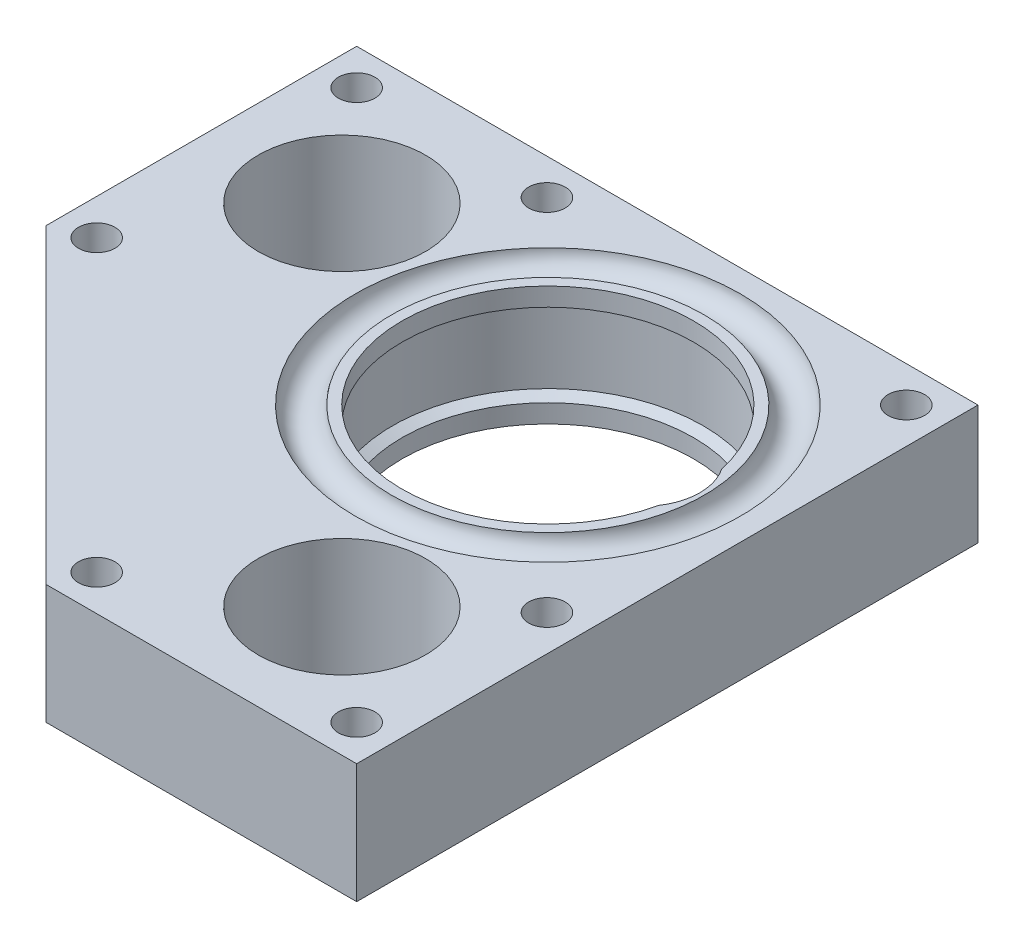
ISO-10303-21;
HEADER;
FILE_DESCRIPTION(('STEP AP214'),'2;1');
FILE_NAME('part.step','',(''),(''),'','','');
FILE_SCHEMA(('AUTOMOTIVE_DESIGN { 1 0 10303 214 1 1 1 1 }'));
ENDSEC;
DATA;
#1=APPLICATION_CONTEXT('core data for automotive mechanical design processes');
#2=APPLICATION_PROTOCOL_DEFINITION('international standard','automotive_design',2000,#1);
#3=PRODUCT_CONTEXT('',#1,'mechanical');
#4=PRODUCT('Part','Part','',(#3));
#5=PRODUCT_RELATED_PRODUCT_CATEGORY('part','',(#4));
#6=PRODUCT_DEFINITION_FORMATION('','',#4);
#7=PRODUCT_DEFINITION_CONTEXT('part definition',#1,'design');
#8=PRODUCT_DEFINITION('design','',#6,#7);
#9=PRODUCT_DEFINITION_SHAPE('','',#8);
#10=(LENGTH_UNIT() NAMED_UNIT(*) SI_UNIT(.MILLI.,.METRE.));
#11=(NAMED_UNIT(*) PLANE_ANGLE_UNIT() SI_UNIT($,.RADIAN.));
#12=(NAMED_UNIT(*) SI_UNIT($,.STERADIAN.) SOLID_ANGLE_UNIT());
#13=UNCERTAINTY_MEASURE_WITH_UNIT(LENGTH_MEASURE(1.E-05),#10,'distance_accuracy_value','');
#14=(GEOMETRIC_REPRESENTATION_CONTEXT(3) GLOBAL_UNCERTAINTY_ASSIGNED_CONTEXT((#13)) GLOBAL_UNIT_ASSIGNED_CONTEXT((#10,
#11,#12)) REPRESENTATION_CONTEXT('',''));
#15=CARTESIAN_POINT('',(0.,0.,0.));
#16=DIRECTION('',(0.,0.,1.));
#17=DIRECTION('',(1.,0.,0.));
#18=AXIS2_PLACEMENT_3D('',#15,#16,#17);
#19=CARTESIAN_POINT('',(0.,7.9375,26.9875));
#20=DIRECTION('',(0.,-1.,0.));
#21=DIRECTION('',(0.,0.,-1.));
#22=AXIS2_PLACEMENT_3D('',#19,#20,#21);
#23=PLANE('',#22);
#24=CARTESIAN_POINT('',(23.8125,7.9375,-23.8125));
#25=DIRECTION('',(0.,-1.,0.));
#26=DIRECTION('',(0.,0.,-1.));
#27=AXIS2_PLACEMENT_3D('',#24,#25,#26);
#28=CIRCLE('',#27,2.4257);
#29=CARTESIAN_POINT('',(23.8125,7.9375,-26.2382));
#30=VERTEX_POINT('',#29);
#31=EDGE_CURVE('E258',#30,#30,#28,.T.);
#32=ORIENTED_EDGE('',*,*,#31,.T.);
#33=EDGE_LOOP('',(#32));
#34=FACE_BOUND('',#33,.T.);
#35=CARTESIAN_POINT('',(-49.2125,7.9375,-23.8125));
#36=DIRECTION('',(0.,-1.,0.));
#37=DIRECTION('',(0.,0.,-1.));
#38=AXIS2_PLACEMENT_3D('',#35,#36,#37);
#39=CIRCLE('',#38,2.4257);
#40=CARTESIAN_POINT('',(-49.2125,7.9375,-26.2382));
#41=VERTEX_POINT('',#40);
#42=EDGE_CURVE('E262',#41,#41,#39,.T.);
#43=ORIENTED_EDGE('',*,*,#42,.T.);
#44=EDGE_LOOP('',(#43));
#45=FACE_BOUND('',#44,.T.);
#46=CARTESIAN_POINT('',(-23.9338853690261,7.9375,-23.8125));
#47=DIRECTION('',(0.,-1.,0.));
#48=DIRECTION('',(0.,0.,-1.));
#49=AXIS2_PLACEMENT_3D('',#46,#47,#48);
#50=CIRCLE('',#49,2.4257);
#51=CARTESIAN_POINT('',(-23.9338853690261,7.9375,-26.2382));
#52=VERTEX_POINT('',#51);
#53=EDGE_CURVE('E266',#52,#52,#50,.T.);
#54=ORIENTED_EDGE('',*,*,#53,.T.);
#55=EDGE_LOOP('',(#54));
#56=FACE_BOUND('',#55,.T.);
#57=CARTESIAN_POINT('',(-49.2125,7.9375,10.7273079091981));
#58=DIRECTION('',(0.,-1.,0.));
#59=DIRECTION('',(0.,0.,-1.));
#60=AXIS2_PLACEMENT_3D('',#57,#58,#59);
#61=CIRCLE('',#60,2.4257);
#62=CARTESIAN_POINT('',(-49.2125,7.9375,8.30160790919813));
#63=VERTEX_POINT('',#62);
#64=EDGE_CURVE('E270',#63,#63,#61,.T.);
#65=ORIENTED_EDGE('',*,*,#64,.T.);
#66=EDGE_LOOP('',(#65));
#67=FACE_BOUND('',#66,.T.);
#68=CARTESIAN_POINT('',(23.8125,7.9375,23.9338853690261));
#69=DIRECTION('',(0.,-1.,0.));
#70=DIRECTION('',(0.,0.,-1.));
#71=AXIS2_PLACEMENT_3D('',#68,#69,#70);
#72=CIRCLE('',#71,2.4257);
#73=CARTESIAN_POINT('',(23.8125,7.9375,21.5081853690261));
#74=VERTEX_POINT('',#73);
#75=EDGE_CURVE('E274',#74,#74,#72,.T.);
#76=ORIENTED_EDGE('',*,*,#75,.T.);
#77=EDGE_LOOP('',(#76));
#78=FACE_BOUND('',#77,.T.);
#79=CARTESIAN_POINT('',(23.8125,7.9375,49.2125));
#80=DIRECTION('',(0.,-1.,0.));
#81=DIRECTION('',(0.,0.,-1.));
#82=AXIS2_PLACEMENT_3D('',#79,#80,#81);
#83=CIRCLE('',#82,2.42570000000001);
#84=CARTESIAN_POINT('',(23.8125,7.9375,46.7868));
#85=VERTEX_POINT('',#84);
#86=EDGE_CURVE('E278',#85,#85,#83,.T.);
#87=ORIENTED_EDGE('',*,*,#86,.T.);
#88=EDGE_LOOP('',(#87));
#89=FACE_BOUND('',#88,.T.);
#90=CARTESIAN_POINT('',(-10.7273079091981,7.9375,49.2125));
#91=DIRECTION('',(0.,-1.,0.));
#92=DIRECTION('',(0.,0.,-1.));
#93=AXIS2_PLACEMENT_3D('',#90,#91,#92);
#94=CIRCLE('',#93,2.42570000000001);
#95=CARTESIAN_POINT('',(-10.7273079091981,7.9375,46.7868));
#96=VERTEX_POINT('',#95);
#97=EDGE_CURVE('E282',#96,#96,#94,.T.);
#98=ORIENTED_EDGE('',*,*,#97,.T.);
#99=EDGE_LOOP('',(#98));
#100=FACE_BOUND('',#99,.T.);
#101=CARTESIAN_POINT('',(9.525,7.9375,36.8901663726257));
#102=DIRECTION('',(0.,1.,0.));
#103=DIRECTION('',(0.,0.,1.));
#104=AXIS2_PLACEMENT_3D('',#101,#102,#103);
#105=CIRCLE('',#104,11.1125);
#106=CARTESIAN_POINT('',(9.525,7.9375,48.0026663726256));
#107=VERTEX_POINT('',#106);
#108=EDGE_CURVE('E286',#107,#107,#105,.T.);
#109=ORIENTED_EDGE('',*,*,#108,.F.);
#110=EDGE_LOOP('',(#109));
#111=FACE_BOUND('',#110,.T.);
#112=CARTESIAN_POINT('',(-36.8901663726257,7.9375,-9.525));
#113=DIRECTION('',(0.,1.,0.));
#114=DIRECTION('',(0.,0.,1.));
#115=AXIS2_PLACEMENT_3D('',#112,#113,#114);
#116=CIRCLE('',#115,11.1125);
#117=CARTESIAN_POINT('',(-36.8901663726257,7.9375,1.5875));
#118=VERTEX_POINT('',#117);
#119=EDGE_CURVE('E151',#118,#118,#116,.T.);
#120=ORIENTED_EDGE('',*,*,#119,.F.);
#121=EDGE_LOOP('',(#120));
#122=FACE_BOUND('',#121,.T.);
#123=CARTESIAN_POINT('',(0.,7.93749999999999,0.));
#124=DIRECTION('',(0.,-1.,0.));
#125=DIRECTION('',(0.,0.,-1.));
#126=AXIS2_PLACEMENT_3D('',#123,#124,#125);
#127=CIRCLE('',#126,25.5871555770483);
#128=CARTESIAN_POINT('',(0.,7.93749999999999,-25.5871555770483));
#129=VERTEX_POINT('',#128);
#130=EDGE_CURVE('E53',#129,#129,#127,.T.);
#131=ORIENTED_EDGE('',*,*,#130,.T.);
#132=EDGE_LOOP('',(#131));
#133=FACE_BOUND('',#132,.T.);
#134=DIRECTION('',(0.,0.,-1.));
#135=VECTOR('',#134,1.);
#136=CARTESIAN_POINT('',(28.575,7.9375,53.975));
#137=LINE('',#136,#135);
#138=CARTESIAN_POINT('',(28.575,7.9375,53.975));
#139=VERTEX_POINT('',#138);
#140=CARTESIAN_POINT('',(28.575,7.9375,-28.575));
#141=VERTEX_POINT('',#140);
#142=EDGE_CURVE('E162',#139,#141,#137,.T.);
#143=ORIENTED_EDGE('',*,*,#142,.T.);
#144=DIRECTION('',(-1.,0.,0.));
#145=VECTOR('',#144,1.);
#146=CARTESIAN_POINT('',(28.575,7.9375,-28.575));
#147=LINE('',#146,#145);
#148=CARTESIAN_POINT('',(-53.975,7.9375,-28.575));
#149=VERTEX_POINT('',#148);
#150=EDGE_CURVE('E120',#141,#149,#147,.T.);
#151=ORIENTED_EDGE('',*,*,#150,.T.);
#152=DIRECTION('',(0.,0.,1.));
#153=VECTOR('',#152,1.);
#154=CARTESIAN_POINT('',(-53.975,7.9375,-28.575));
#155=LINE('',#154,#153);
#156=CARTESIAN_POINT('',(-53.975,7.9375,12.7));
#157=VERTEX_POINT('',#156);
#158=EDGE_CURVE('E168',#149,#157,#155,.T.);
#159=ORIENTED_EDGE('',*,*,#158,.T.);
#160=DIRECTION('',(0.707106781186548,0.,0.707106781186548));
#161=VECTOR('',#160,1.);
#162=CARTESIAN_POINT('',(-53.975,7.9375,12.7));
#163=LINE('',#162,#161);
#164=CARTESIAN_POINT('',(-12.7,7.9375,53.975));
#165=VERTEX_POINT('',#164);
#166=EDGE_CURVE('E148',#157,#165,#163,.T.);
#167=ORIENTED_EDGE('',*,*,#166,.T.);
#168=DIRECTION('',(1.,0.,0.));
#169=VECTOR('',#168,1.);
#170=CARTESIAN_POINT('',(-12.7,7.9375,53.975));
#171=LINE('',#170,#169);
#172=EDGE_CURVE('E144',#165,#139,#171,.T.);
#173=ORIENTED_EDGE('',*,*,#172,.T.);
#174=EDGE_LOOP('',(#143,#151,#159,#167,#173));
#175=FACE_BOUND('',#174,.T.);
#176=ADVANCED_FACE('F39',(#34,#45,#56,#67,#78,#89,#100,#111,#122,#133,#175),#23,.F.);
#177=CARTESIAN_POINT('',(0.,8.0645,0.));
#178=DIRECTION('',(0.,-1.,0.));
#179=DIRECTION('',(0.,0.,-1.));
#180=AXIS2_PLACEMENT_3D('',#177,#178,#179);
#181=TOROIDAL_SURFACE('',#180,23.1775,2.413);
#182=ORIENTED_EDGE('',*,*,#130,.F.);
#183=EDGE_LOOP('',(#182));
#184=FACE_BOUND('',#183,.T.);
#185=CARTESIAN_POINT('',(0.,7.9375,0.));
#186=DIRECTION('',(0.,-1.,0.));
#187=DIRECTION('',(0.,0.,-1.));
#188=AXIS2_PLACEMENT_3D('',#185,#186,#187);
#189=CIRCLE('',#188,20.7678444229517);
#190=CARTESIAN_POINT('',(0.,7.9375,-20.7678444229517));
#191=VERTEX_POINT('',#190);
#192=EDGE_CURVE('E399',#191,#191,#189,.T.);
#193=ORIENTED_EDGE('',*,*,#192,.T.);
#194=EDGE_LOOP('',(#193));
#195=FACE_BOUND('',#194,.T.);
#196=ADVANCED_FACE('F248',(#184,#195),#181,.F.);
#197=CARTESIAN_POINT('',(0.,7.9375,19.3675));
#198=DIRECTION('',(0.,-1.,0.));
#199=DIRECTION('',(0.,0.,-1.));
#200=AXIS2_PLACEMENT_3D('',#197,#198,#199);
#201=PLANE('',#200);
#202=ORIENTED_EDGE('',*,*,#192,.F.);
#203=EDGE_LOOP('',(#202));
#204=FACE_BOUND('',#203,.T.);
#205=CARTESIAN_POINT('',(0.,7.9375,0.));
#206=DIRECTION('',(0.,-1.,0.));
#207=DIRECTION('',(0.,0.,-1.));
#208=AXIS2_PLACEMENT_3D('',#205,#206,#207);
#209=CIRCLE('',#208,19.3675);
#210=CARTESIAN_POINT('',(18.90728375,7.9375,4.19698432770315));
#211=VERTEX_POINT('',#210);
#212=CARTESIAN_POINT('',(18.90728375,7.9375,-4.19698432770315));
#213=VERTEX_POINT('',#212);
#214=EDGE_CURVE('E395',#211,#213,#209,.T.);
#215=ORIENTED_EDGE('',*,*,#214,.T.);
#216=CARTESIAN_POINT('',(12.7,7.9375,0.));
#217=DIRECTION('',(0.,1.,0.));
#218=DIRECTION('',(0.,0.,1.));
#219=AXIS2_PLACEMENT_3D('',#216,#217,#218);
#220=CIRCLE('',#219,7.493);
#221=EDGE_CURVE('E177',#211,#213,#220,.T.);
#222=ORIENTED_EDGE('',*,*,#221,.F.);
#223=EDGE_LOOP('',(#215,#222));
#224=FACE_BOUND('',#223,.T.);
#225=ADVANCED_FACE('F253',(#204,#224),#201,.F.);
#226=CARTESIAN_POINT('',(0.,0.,0.));
#227=DIRECTION('',(0.,-1.,0.));
#228=DIRECTION('',(0.,0.,-1.));
#229=AXIS2_PLACEMENT_3D('',#226,#227,#228);
#230=CYLINDRICAL_SURFACE('',#229,19.3675);
#231=ORIENTED_EDGE('',*,*,#214,.F.);
#232=DIRECTION('',(0.,1.,0.));
#233=VECTOR('',#232,1.);
#234=CARTESIAN_POINT('',(18.90728375,0.,4.19698432770316));
#235=LINE('',#234,#233);
#236=CARTESIAN_POINT('',(18.90728375,5.49573484187081,4.19698432770316));
#237=VERTEX_POINT('',#236);
#238=EDGE_CURVE('E413',#211,#237,#235,.F.);
#239=ORIENTED_EDGE('',*,*,#238,.T.);
#240=CARTESIAN_POINT('',(0.,5.49573484187081,0.));
#241=DIRECTION('',(0.,-1.,0.));
#242=DIRECTION('',(0.,0.,-1.));
#243=AXIS2_PLACEMENT_3D('',#240,#241,#242);
#244=CIRCLE('',#243,19.3675);
#245=CARTESIAN_POINT('',(18.90728375,5.49573484187081,-4.19698432770316));
#246=VERTEX_POINT('',#245);
#247=EDGE_CURVE('E385',#237,#246,#244,.T.);
#248=ORIENTED_EDGE('',*,*,#247,.T.);
#249=DIRECTION('',(0.,1.,0.));
#250=VECTOR('',#249,1.);
#251=CARTESIAN_POINT('',(18.90728375,0.,-4.19698432770316));
#252=LINE('',#251,#250);
#253=EDGE_CURVE('E60',#246,#213,#252,.T.);
#254=ORIENTED_EDGE('',*,*,#253,.T.);
#255=EDGE_LOOP('',(#231,#239,#248,#254));
#256=FACE_BOUND('',#255,.T.);
#257=ADVANCED_FACE('F243',(#256),#230,.F.);
#258=CARTESIAN_POINT('',(0.,4.7625,0.));
#259=DIRECTION('',(0.,-1.,0.));
#260=DIRECTION('',(0.,0.,-1.));
#261=AXIS2_PLACEMENT_3D('',#258,#259,#260);
#262=CONICAL_SURFACE('',#261,20.6375,1.0471975511966);
#263=ORIENTED_EDGE('',*,*,#247,.F.);
#264=CARTESIAN_POINT('',(18.9067554792281,5.49593484187081,4.19776552716703));
#265=CARTESIAN_POINT('',(19.0174993900621,5.4540104024532,4.03406574557647));
#266=CARTESIAN_POINT('',(19.1220398905923,5.41466474604031,3.86549214792238));
#267=CARTESIAN_POINT('',(19.3178748512189,5.34129458503462,3.51968351005283));
#268=CARTESIAN_POINT('',(19.4091674247964,5.30727083823383,3.34244724105811));
#269=CARTESIAN_POINT('',(19.5776668251635,5.24470840807489,2.98037895360555));
#270=CARTESIAN_POINT('',(19.6548683702748,5.21617178121638,2.79554411868589));
#271=CARTESIAN_POINT('',(19.7944186005398,5.16474333419237,2.41960032925531));
#272=CARTESIAN_POINT('',(19.8567683052602,5.14185112653835,2.2284918064533));
#273=CARTESIAN_POINT('',(19.9660967629609,5.10179966147627,1.84104862262559));
#274=CARTESIAN_POINT('',(20.0130541238081,5.08464838206219,1.64470709489376));
#275=CARTESIAN_POINT('',(20.0910192634318,5.05621305134426,1.24846103410571));
#276=CARTESIAN_POINT('',(20.1220269413055,5.04492903715852,1.04855647851695));
#277=CARTESIAN_POINT('',(20.1677675384391,5.02829507179111,0.646794922372262));
#278=CARTESIAN_POINT('',(20.1825121930129,5.02294084169629,0.444939435840834));
#279=CARTESIAN_POINT('',(20.1956190434831,5.01818097598665,0.0406330740790804));
#280=CARTESIAN_POINT('',(20.1939818084006,5.01877513375596,-0.16181778022709));
#281=CARTESIAN_POINT('',(20.1745186259189,5.02584444769861,-0.562201430762554));
#282=CARTESIAN_POINT('',(20.1569828173068,5.03221420311289,-0.760150260443973));
#283=CARTESIAN_POINT('',(20.1062981570415,5.05065376781338,-1.15376579767299));
#284=CARTESIAN_POINT('',(20.0731494397099,5.06272352806114,-1.34943252483921));
#285=CARTESIAN_POINT('',(19.9915361815194,5.09250778762843,-1.73718238920346));
#286=CARTESIAN_POINT('',(19.9430666058663,5.1102241425677,-1.92926432634831));
#287=CARTESIAN_POINT('',(19.8313045210998,5.15119876268703,-2.30838250797133));
#288=CARTESIAN_POINT('',(19.7680146595351,5.17445603803026,-2.49541964702258));
#289=CARTESIAN_POINT('',(19.5945656014545,5.23843200887757,-2.94836092688657));
#290=CARTESIAN_POINT('',(19.4762608302224,5.28225402633888,-3.21078600659654));
#291=CARTESIAN_POINT('',(19.2778578093211,5.3562817142002,-3.59128274756089));
#292=CARTESIAN_POINT('',(19.2083010327033,5.38231420699234,-3.71582374849114));
#293=CARTESIAN_POINT('',(19.0624819165615,5.43709858227203,-3.9603173567989));
#294=CARTESIAN_POINT('',(18.9862188269537,5.46585076897757,-4.0802694487602));
#295=CARTESIAN_POINT('',(18.9067554792275,5.49593484187104,-4.19776552716791));
#296=B_SPLINE_CURVE_WITH_KNOTS('',3,(#264,#265,#266,#267,#268,#269,#270,#271,#272,#273,#274,
#275,#276,#277,#278,#279,#280,#281,#282,#283,#284,#285,#286,#287,#288,#289,#290,#291,#292,#293,
#294,#295),.UNSPECIFIED.,.F.,.F.,(4,2,2,2,2,2,2,2,2,2,2,2,2,2,2,4),(0.,0.605966956283505,
1.2120201184126,1.81829998036732,2.42453820970712,3.03161544575461,3.63869652231194,
4.24533924510818,4.85196089638205,5.44773013398672,6.04349424614406,6.63945434429834,
7.2353080591314,8.10640598240122,8.54121047491856,8.9760636611961),.UNSPECIFIED.);
#297=EDGE_CURVE('E198',#237,#246,#296,.T.);
#298=ORIENTED_EDGE('',*,*,#297,.T.);
#299=EDGE_LOOP('',(#263,#298));
#300=FACE_BOUND('',#299,.T.);
#301=CARTESIAN_POINT('',(0.,4.7625,0.));
#302=DIRECTION('',(0.,-1.,0.));
#303=DIRECTION('',(0.,0.,-1.));
#304=AXIS2_PLACEMENT_3D('',#301,#302,#303);
#305=CIRCLE('',#304,20.6375);
#306=CARTESIAN_POINT('',(0.,4.7625,-20.6375));
#307=VERTEX_POINT('',#306);
#308=EDGE_CURVE('E379',#307,#307,#305,.T.);
#309=ORIENTED_EDGE('',*,*,#308,.T.);
#310=EDGE_LOOP('',(#309));
#311=FACE_BOUND('',#310,.T.);
#312=ADVANCED_FACE('F207',(#300,#311),#262,.F.);
#313=CARTESIAN_POINT('',(0.,0.,0.));
#314=DIRECTION('',(0.,-1.,0.));
#315=DIRECTION('',(0.,0.,-1.));
#316=AXIS2_PLACEMENT_3D('',#313,#314,#315);
#317=CYLINDRICAL_SURFACE('',#316,20.6375);
#318=ORIENTED_EDGE('',*,*,#308,.F.);
#319=EDGE_LOOP('',(#318));
#320=FACE_BOUND('',#319,.T.);
#321=CARTESIAN_POINT('',(0.,-4.7625,0.));
#322=DIRECTION('',(0.,-1.,0.));
#323=DIRECTION('',(0.,0.,-1.));
#324=AXIS2_PLACEMENT_3D('',#321,#322,#323);
#325=CIRCLE('',#324,20.6375);
#326=CARTESIAN_POINT('',(0.,-4.7625,-20.6375));
#327=VERTEX_POINT('',#326);
#328=EDGE_CURVE('E417',#327,#327,#325,.T.);
#329=ORIENTED_EDGE('',*,*,#328,.T.);
#330=EDGE_LOOP('',(#329));
#331=FACE_BOUND('',#330,.T.);
#332=ADVANCED_FACE('F236',(#320,#331),#317,.F.);
#333=CARTESIAN_POINT('',(0.,-7.9375,26.9875));
#334=DIRECTION('',(0.,1.,0.));
#335=DIRECTION('',(0.,0.,-1.));
#336=AXIS2_PLACEMENT_3D('',#333,#334,#335);
#337=PLANE('',#336);
#338=CARTESIAN_POINT('',(23.8125,-7.9375,-23.8125));
#339=DIRECTION('',(0.,1.,0.));
#340=DIRECTION('',(0.,0.,1.));
#341=AXIS2_PLACEMENT_3D('',#338,#339,#340);
#342=CIRCLE('',#341,2.4257);
#343=CARTESIAN_POINT('',(23.8125,-7.9375,-21.3868));
#344=VERTEX_POINT('',#343);
#345=EDGE_CURVE('E357',#344,#344,#342,.T.);
#346=ORIENTED_EDGE('',*,*,#345,.T.);
#347=EDGE_LOOP('',(#346));
#348=FACE_BOUND('',#347,.T.);
#349=CARTESIAN_POINT('',(-49.2125,-7.9375,-23.8125));
#350=DIRECTION('',(0.,1.,0.));
#351=DIRECTION('',(0.,0.,1.));
#352=AXIS2_PLACEMENT_3D('',#349,#350,#351);
#353=CIRCLE('',#352,2.4257);
#354=CARTESIAN_POINT('',(-49.2125,-7.9375,-21.3868));
#355=VERTEX_POINT('',#354);
#356=EDGE_CURVE('E630',#355,#355,#353,.T.);
#357=ORIENTED_EDGE('',*,*,#356,.T.);
#358=EDGE_LOOP('',(#357));
#359=FACE_BOUND('',#358,.T.);
#360=CARTESIAN_POINT('',(-23.9338853690261,-7.9375,-23.8125));
#361=DIRECTION('',(0.,1.,0.));
#362=DIRECTION('',(0.,0.,1.));
#363=AXIS2_PLACEMENT_3D('',#360,#361,#362);
#364=CIRCLE('',#363,2.4257);
#365=CARTESIAN_POINT('',(-23.9338853690261,-7.9375,-21.3868));
#366=VERTEX_POINT('',#365);
#367=EDGE_CURVE('E626',#366,#366,#364,.T.);
#368=ORIENTED_EDGE('',*,*,#367,.T.);
#369=EDGE_LOOP('',(#368));
#370=FACE_BOUND('',#369,.T.);
#371=CARTESIAN_POINT('',(-49.2125,-7.9375,10.7273079091981));
#372=DIRECTION('',(0.,1.,0.));
#373=DIRECTION('',(0.,0.,1.));
#374=AXIS2_PLACEMENT_3D('',#371,#372,#373);
#375=CIRCLE('',#374,2.4257);
#376=CARTESIAN_POINT('',(-49.2125,-7.9375,13.1530079091981));
#377=VERTEX_POINT('',#376);
#378=EDGE_CURVE('E622',#377,#377,#375,.T.);
#379=ORIENTED_EDGE('',*,*,#378,.T.);
#380=EDGE_LOOP('',(#379));
#381=FACE_BOUND('',#380,.T.);
#382=CARTESIAN_POINT('',(23.8125,-7.9375,23.9338853690261));
#383=DIRECTION('',(0.,1.,0.));
#384=DIRECTION('',(0.,0.,-1.));
#385=AXIS2_PLACEMENT_3D('',#382,#383,#384);
#386=CIRCLE('',#385,2.4257);
#387=CARTESIAN_POINT('',(23.8125,-7.9375,21.5081853690261));
#388=VERTEX_POINT('',#387);
#389=EDGE_CURVE('E618',#388,#388,#386,.T.);
#390=ORIENTED_EDGE('',*,*,#389,.T.);
#391=EDGE_LOOP('',(#390));
#392=FACE_BOUND('',#391,.T.);
#393=CARTESIAN_POINT('',(23.8125,-7.9375,49.2125));
#394=DIRECTION('',(0.,1.,0.));
#395=DIRECTION('',(0.,0.,-1.));
#396=AXIS2_PLACEMENT_3D('',#393,#394,#395);
#397=CIRCLE('',#396,2.42570000000001);
#398=CARTESIAN_POINT('',(23.8125,-7.9375,46.7868));
#399=VERTEX_POINT('',#398);
#400=EDGE_CURVE('E614',#399,#399,#397,.T.);
#401=ORIENTED_EDGE('',*,*,#400,.T.);
#402=EDGE_LOOP('',(#401));
#403=FACE_BOUND('',#402,.T.);
#404=CARTESIAN_POINT('',(-10.7273079091981,-7.9375,49.2125));
#405=DIRECTION('',(0.,1.,0.));
#406=DIRECTION('',(0.,0.,-1.));
#407=AXIS2_PLACEMENT_3D('',#404,#405,#406);
#408=CIRCLE('',#407,2.42570000000001);
#409=CARTESIAN_POINT('',(-10.7273079091981,-7.9375,46.7868));
#410=VERTEX_POINT('',#409);
#411=EDGE_CURVE('E610',#410,#410,#408,.T.);
#412=ORIENTED_EDGE('',*,*,#411,.T.);
#413=EDGE_LOOP('',(#412));
#414=FACE_BOUND('',#413,.T.);
#415=CARTESIAN_POINT('',(9.525,-7.9375,36.8901663726257));
#416=DIRECTION('',(0.,1.,0.));
#417=DIRECTION('',(0.,0.,1.));
#418=AXIS2_PLACEMENT_3D('',#415,#416,#417);
#419=CIRCLE('',#418,11.1125);
#420=CARTESIAN_POINT('',(9.525,-7.9375,48.0026663726256));
#421=VERTEX_POINT('',#420);
#422=EDGE_CURVE('E362',#421,#421,#419,.T.);
#423=ORIENTED_EDGE('',*,*,#422,.T.);
#424=EDGE_LOOP('',(#423));
#425=FACE_BOUND('',#424,.T.);
#426=CARTESIAN_POINT('',(-36.8901663726257,-7.9375,-9.525));
#427=DIRECTION('',(0.,1.,0.));
#428=DIRECTION('',(0.,0.,1.));
#429=AXIS2_PLACEMENT_3D('',#426,#427,#428);
#430=CIRCLE('',#429,11.1125);
#431=CARTESIAN_POINT('',(-36.8901663726257,-7.9375,1.5875));
#432=VERTEX_POINT('',#431);
#433=EDGE_CURVE('E165',#432,#432,#430,.T.);
#434=ORIENTED_EDGE('',*,*,#433,.T.);
#435=EDGE_LOOP('',(#434));
#436=FACE_BOUND('',#435,.T.);
#437=CARTESIAN_POINT('',(0.,-7.93749999999999,0.));
#438=DIRECTION('',(0.,-1.,0.));
#439=DIRECTION('',(0.,0.,-1.));
#440=AXIS2_PLACEMENT_3D('',#437,#438,#439);
#441=CIRCLE('',#440,25.5871555770483);
#442=CARTESIAN_POINT('',(0.,-7.93749999999999,-25.5871555770483));
#443=VERTEX_POINT('',#442);
#444=EDGE_CURVE('E377',#443,#443,#441,.T.);
#445=ORIENTED_EDGE('',*,*,#444,.F.);
#446=EDGE_LOOP('',(#445));
#447=FACE_BOUND('',#446,.T.);
#448=DIRECTION('',(0.,0.,-1.));
#449=VECTOR('',#448,1.);
#450=CARTESIAN_POINT('',(28.575,-7.9375,53.975));
#451=LINE('',#450,#449);
#452=CARTESIAN_POINT('',(28.575,-7.9375,53.975));
#453=VERTEX_POINT('',#452);
#454=CARTESIAN_POINT('',(28.575,-7.9375,-28.575));
#455=VERTEX_POINT('',#454);
#456=EDGE_CURVE('E134',#453,#455,#451,.T.);
#457=ORIENTED_EDGE('',*,*,#456,.F.);
#458=DIRECTION('',(1.,0.,0.));
#459=VECTOR('',#458,1.);
#460=CARTESIAN_POINT('',(-12.7,-7.9375,53.975));
#461=LINE('',#460,#459);
#462=CARTESIAN_POINT('',(-12.7,-7.9375,53.975));
#463=VERTEX_POINT('',#462);
#464=EDGE_CURVE('E127',#463,#453,#461,.T.);
#465=ORIENTED_EDGE('',*,*,#464,.F.);
#466=DIRECTION('',(0.707106781186548,0.,0.707106781186548));
#467=VECTOR('',#466,1.);
#468=CARTESIAN_POINT('',(-53.975,-7.9375,12.7));
#469=LINE('',#468,#467);
#470=CARTESIAN_POINT('',(-53.975,-7.9375,12.7));
#471=VERTEX_POINT('',#470);
#472=EDGE_CURVE('E156',#471,#463,#469,.T.);
#473=ORIENTED_EDGE('',*,*,#472,.F.);
#474=DIRECTION('',(0.,0.,1.));
#475=VECTOR('',#474,1.);
#476=CARTESIAN_POINT('',(-53.975,-7.9375,-28.575));
#477=LINE('',#476,#475);
#478=CARTESIAN_POINT('',(-53.975,-7.9375,-28.575));
#479=VERTEX_POINT('',#478);
#480=EDGE_CURVE('E138',#479,#471,#477,.T.);
#481=ORIENTED_EDGE('',*,*,#480,.F.);
#482=DIRECTION('',(-1.,0.,0.));
#483=VECTOR('',#482,1.);
#484=CARTESIAN_POINT('',(28.575,-7.9375,-28.575));
#485=LINE('',#484,#483);
#486=EDGE_CURVE('E118',#455,#479,#485,.T.);
#487=ORIENTED_EDGE('',*,*,#486,.F.);
#488=EDGE_LOOP('',(#457,#465,#473,#481,#487));
#489=FACE_BOUND('',#488,.T.);
#490=ADVANCED_FACE('F132',(#348,#359,#370,#381,#392,#403,#414,#425,#436,#447,#489),#337,.F.);
#491=CARTESIAN_POINT('',(0.,-8.0645,0.));
#492=DIRECTION('',(0.,1.,0.));
#493=DIRECTION('',(0.,0.,-1.));
#494=AXIS2_PLACEMENT_3D('',#491,#492,#493);
#495=TOROIDAL_SURFACE('',#494,23.1775,2.413);
#496=ORIENTED_EDGE('',*,*,#444,.T.);
#497=EDGE_LOOP('',(#496));
#498=FACE_BOUND('',#497,.T.);
#499=CARTESIAN_POINT('',(0.,-7.9375,0.));
#500=DIRECTION('',(0.,-1.,0.));
#501=DIRECTION('',(0.,0.,-1.));
#502=AXIS2_PLACEMENT_3D('',#499,#500,#501);
#503=CIRCLE('',#502,20.7678444229517);
#504=CARTESIAN_POINT('',(0.,-7.9375,-20.7678444229517));
#505=VERTEX_POINT('',#504);
#506=EDGE_CURVE('E380',#505,#505,#503,.T.);
#507=ORIENTED_EDGE('',*,*,#506,.F.);
#508=EDGE_LOOP('',(#507));
#509=FACE_BOUND('',#508,.T.);
#510=ADVANCED_FACE('F230',(#498,#509),#495,.F.);
#511=CARTESIAN_POINT('',(0.,-7.9375,19.3675));
#512=DIRECTION('',(0.,1.,0.));
#513=DIRECTION('',(0.,0.,-1.));
#514=AXIS2_PLACEMENT_3D('',#511,#512,#513);
#515=PLANE('',#514);
#516=ORIENTED_EDGE('',*,*,#506,.T.);
#517=EDGE_LOOP('',(#516));
#518=FACE_BOUND('',#517,.T.);
#519=CARTESIAN_POINT('',(0.,-7.9375,0.));
#520=DIRECTION('',(0.,-1.,0.));
#521=DIRECTION('',(0.,0.,-1.));
#522=AXIS2_PLACEMENT_3D('',#519,#520,#521);
#523=CIRCLE('',#522,19.3675);
#524=CARTESIAN_POINT('',(18.90728375,-7.9375,4.19698432770315));
#525=VERTEX_POINT('',#524);
#526=CARTESIAN_POINT('',(18.90728375,-7.9375,-4.19698432770315));
#527=VERTEX_POINT('',#526);
#528=EDGE_CURVE('E388',#525,#527,#523,.T.);
#529=ORIENTED_EDGE('',*,*,#528,.F.);
#530=CARTESIAN_POINT('',(12.7,-7.9375,0.));
#531=DIRECTION('',(0.,1.,0.));
#532=DIRECTION('',(0.,0.,1.));
#533=AXIS2_PLACEMENT_3D('',#530,#531,#532);
#534=CIRCLE('',#533,7.493);
#535=EDGE_CURVE('E188',#525,#527,#534,.T.);
#536=ORIENTED_EDGE('',*,*,#535,.T.);
#537=EDGE_LOOP('',(#529,#536));
#538=FACE_BOUND('',#537,.T.);
#539=ADVANCED_FACE('F226',(#518,#538),#515,.F.);
#540=CARTESIAN_POINT('',(0.,0.,0.));
#541=DIRECTION('',(0.,1.,0.));
#542=DIRECTION('',(0.,0.,-1.));
#543=AXIS2_PLACEMENT_3D('',#540,#541,#542);
#544=CYLINDRICAL_SURFACE('',#543,19.3675);
#545=ORIENTED_EDGE('',*,*,#528,.T.);
#546=DIRECTION('',(0.,1.,0.));
#547=VECTOR('',#546,1.);
#548=CARTESIAN_POINT('',(18.90728375,0.,-4.19698432770316));
#549=LINE('',#548,#547);
#550=CARTESIAN_POINT('',(18.90728375,-5.49573484187081,-4.19698432770316));
#551=VERTEX_POINT('',#550);
#552=EDGE_CURVE('E194',#527,#551,#549,.T.);
#553=ORIENTED_EDGE('',*,*,#552,.T.);
#554=CARTESIAN_POINT('',(0.,-5.49573484187081,0.));
#555=DIRECTION('',(0.,-1.,0.));
#556=DIRECTION('',(0.,0.,-1.));
#557=AXIS2_PLACEMENT_3D('',#554,#555,#556);
#558=CIRCLE('',#557,19.3675);
#559=CARTESIAN_POINT('',(18.90728375,-5.49573484187081,4.19698432770316));
#560=VERTEX_POINT('',#559);
#561=EDGE_CURVE('E420',#560,#551,#558,.T.);
#562=ORIENTED_EDGE('',*,*,#561,.F.);
#563=DIRECTION('',(0.,1.,0.));
#564=VECTOR('',#563,1.);
#565=CARTESIAN_POINT('',(18.90728375,0.,4.19698432770316));
#566=LINE('',#565,#564);
#567=EDGE_CURVE('E68',#560,#525,#566,.F.);
#568=ORIENTED_EDGE('',*,*,#567,.T.);
#569=EDGE_LOOP('',(#545,#553,#562,#568));
#570=FACE_BOUND('',#569,.T.);
#571=ADVANCED_FACE('F222',(#570),#544,.F.);
#572=CARTESIAN_POINT('',(0.,-4.7625,0.));
#573=DIRECTION('',(0.,1.,0.));
#574=DIRECTION('',(0.,0.,-1.));
#575=AXIS2_PLACEMENT_3D('',#572,#573,#574);
#576=CONICAL_SURFACE('',#575,20.6375,1.0471975511966);
#577=ORIENTED_EDGE('',*,*,#561,.T.);
#578=CARTESIAN_POINT('',(18.9067554792275,-5.49593484187104,-4.19776552716791));
#579=CARTESIAN_POINT('',(19.0174993900615,-5.45401040245341,-4.03406574557736));
#580=CARTESIAN_POINT('',(19.1220398905917,-5.41466474604052,-3.86549214792329));
#581=CARTESIAN_POINT('',(19.3178748512184,-5.34129458503481,-3.51968351005376));
#582=CARTESIAN_POINT('',(19.4091674247959,-5.30727083823401,-3.34244724105905));
#583=CARTESIAN_POINT('',(19.5776668251631,-5.24470840807504,-2.98037895360651));
#584=CARTESIAN_POINT('',(19.6548683702744,-5.21617178121652,-2.79554411868687));
#585=CARTESIAN_POINT('',(19.7944186005395,-5.16474333419249,-2.4196003292563));
#586=CARTESIAN_POINT('',(19.8567683052599,-5.14185112653846,-2.2284918064543));
#587=CARTESIAN_POINT('',(19.9660967629606,-5.10179966147636,-1.8410486226266));
#588=CARTESIAN_POINT('',(20.0130541238079,-5.08464838206227,-1.64470709489478));
#589=CARTESIAN_POINT('',(20.0910192634316,-5.05621305134432,-1.24846103410673));
#590=CARTESIAN_POINT('',(20.1220269413054,-5.04492903715857,-1.04855647851797));
#591=CARTESIAN_POINT('',(20.167767538439,-5.02829507179115,-0.646794922373283));
#592=CARTESIAN_POINT('',(20.1825121930129,-5.02294084169631,-0.444939435841855));
#593=CARTESIAN_POINT('',(20.1956190434831,-5.01818097598666,-0.0406330740800967));
#594=CARTESIAN_POINT('',(20.1939818084006,-5.01877513375595,0.161817780226077));
#595=CARTESIAN_POINT('',(20.174518625919,-5.02584444769858,0.562201430761549));
#596=CARTESIAN_POINT('',(20.1569828173069,-5.03221420311285,0.760150260442972));
#597=CARTESIAN_POINT('',(20.1062981570417,-5.05065376781333,1.153765797672));
#598=CARTESIAN_POINT('',(20.0731494397101,-5.06272352806107,1.34943252483823));
#599=CARTESIAN_POINT('',(19.9915361815196,-5.09250778762834,1.73718238920249));
#600=CARTESIAN_POINT('',(19.9430666058665,-5.11022414256761,1.92926432634735));
#601=CARTESIAN_POINT('',(19.8313045211001,-5.15119876268692,2.30838250797038));
#602=CARTESIAN_POINT('',(19.7680146595354,-5.17445603803014,2.49541964702164));
#603=CARTESIAN_POINT('',(19.5945656014549,-5.23843200887743,2.94836092688565));
#604=CARTESIAN_POINT('',(19.4762608302228,-5.28225402633872,3.21078600659562));
#605=CARTESIAN_POINT('',(19.2778578093216,-5.35628171420002,3.59128274755998));
#606=CARTESIAN_POINT('',(19.2083010327038,-5.38231420699215,3.71582374849024));
#607=CARTESIAN_POINT('',(19.0624819165621,-5.43709858227182,3.96031735679801));
#608=CARTESIAN_POINT('',(18.9862188269543,-5.46585076897735,4.08026944875931));
#609=CARTESIAN_POINT('',(18.9067554792281,-5.49593484187081,4.19776552716703));
#610=B_SPLINE_CURVE_WITH_KNOTS('',3,(#578,#579,#580,#581,#582,#583,#584,#585,#586,#587,#588,
#589,#590,#591,#592,#593,#594,#595,#596,#597,#598,#599,#600,#601,#602,#603,#604,#605,#606,#607,
#608,#609),.UNSPECIFIED.,.F.,.F.,(4,2,2,2,2,2,2,2,2,2,2,2,2,2,2,4),(0.,0.605966956283516,
1.21202011841262,1.81829998036735,2.42453820970716,3.03161544575466,3.638696522312,
4.24533924510824,4.85196089638213,5.4477301339868,6.04349424614415,6.63945434429843,
7.23530805913149,8.10640598240126,8.54121047491858,8.9760636611961),.UNSPECIFIED.);
#611=EDGE_CURVE('E11',#551,#560,#610,.T.);
#612=ORIENTED_EDGE('',*,*,#611,.T.);
#613=EDGE_LOOP('',(#577,#612));
#614=FACE_BOUND('',#613,.T.);
#615=ORIENTED_EDGE('',*,*,#328,.F.);
#616=EDGE_LOOP('',(#615));
#617=FACE_BOUND('',#616,.T.);
#618=ADVANCED_FACE('F217',(#614,#617),#576,.F.);
#619=CARTESIAN_POINT('',(12.7,-7.9375,0.));
#620=DIRECTION('',(0.,1.,0.));
#621=DIRECTION('',(0.,0.,1.));
#622=AXIS2_PLACEMENT_3D('',#619,#620,#621);
#623=CYLINDRICAL_SURFACE('',#622,7.493);
#624=ORIENTED_EDGE('',*,*,#535,.F.);
#625=ORIENTED_EDGE('',*,*,#567,.F.);
#626=ORIENTED_EDGE('',*,*,#611,.F.);
#627=ORIENTED_EDGE('',*,*,#552,.F.);
#628=EDGE_LOOP('',(#624,#625,#626,#627));
#629=FACE_BOUND('',#628,.T.);
#630=ADVANCED_FACE('F215',(#629),#623,.F.);
#631=ORIENTED_EDGE('',*,*,#221,.T.);
#632=ORIENTED_EDGE('',*,*,#253,.F.);
#633=ORIENTED_EDGE('',*,*,#297,.F.);
#634=ORIENTED_EDGE('',*,*,#238,.F.);
#635=EDGE_LOOP('',(#631,#632,#633,#634));
#636=FACE_BOUND('',#635,.T.);
#637=ADVANCED_FACE('F211',(#636),#623,.F.);
#638=CARTESIAN_POINT('',(28.575,-7.9375,53.975));
#639=DIRECTION('',(1.,0.,0.));
#640=DIRECTION('',(0.,0.,-1.));
#641=AXIS2_PLACEMENT_3D('',#638,#639,#640);
#642=PLANE('',#641);
#643=ORIENTED_EDGE('',*,*,#142,.F.);
#644=DIRECTION('',(0.,1.,0.));
#645=VECTOR('',#644,1.);
#646=CARTESIAN_POINT('',(28.575,-7.9375,53.975));
#647=LINE('',#646,#645);
#648=EDGE_CURVE('E142',#453,#139,#647,.T.);
#649=ORIENTED_EDGE('',*,*,#648,.F.);
#650=ORIENTED_EDGE('',*,*,#456,.T.);
#651=DIRECTION('',(0.,1.,0.));
#652=VECTOR('',#651,1.);
#653=CARTESIAN_POINT('',(28.575,-7.9375,-28.575));
#654=LINE('',#653,#652);
#655=EDGE_CURVE('E115',#455,#141,#654,.T.);
#656=ORIENTED_EDGE('',*,*,#655,.T.);
#657=EDGE_LOOP('',(#643,#649,#650,#656));
#658=FACE_BOUND('',#657,.T.);
#659=ADVANCED_FACE('F141',(#658),#642,.T.);
#660=CARTESIAN_POINT('',(-12.7,-7.9375,53.975));
#661=DIRECTION('',(0.,0.,1.));
#662=DIRECTION('',(1.,0.,0.));
#663=AXIS2_PLACEMENT_3D('',#660,#661,#662);
#664=PLANE('',#663);
#665=ORIENTED_EDGE('',*,*,#172,.F.);
#666=DIRECTION('',(0.,1.,0.));
#667=VECTOR('',#666,1.);
#668=CARTESIAN_POINT('',(-12.7,-7.9375,53.975));
#669=LINE('',#668,#667);
#670=EDGE_CURVE('E178',#463,#165,#669,.T.);
#671=ORIENTED_EDGE('',*,*,#670,.F.);
#672=ORIENTED_EDGE('',*,*,#464,.T.);
#673=ORIENTED_EDGE('',*,*,#648,.T.);
#674=EDGE_LOOP('',(#665,#671,#672,#673));
#675=FACE_BOUND('',#674,.T.);
#676=ADVANCED_FACE('F296',(#675),#664,.T.);
#677=CARTESIAN_POINT('',(-53.975,-7.9375,12.7));
#678=DIRECTION('',(-0.707106781186547,0.,0.707106781186548));
#679=DIRECTION('',(0.707106781186548,0.,0.707106781186547));
#680=AXIS2_PLACEMENT_3D('',#677,#678,#679);
#681=PLANE('',#680);
#682=ORIENTED_EDGE('',*,*,#166,.F.);
#683=DIRECTION('',(0.,1.,0.));
#684=VECTOR('',#683,1.);
#685=CARTESIAN_POINT('',(-53.975,-7.9375,12.7));
#686=LINE('',#685,#684);
#687=EDGE_CURVE('E181',#471,#157,#686,.T.);
#688=ORIENTED_EDGE('',*,*,#687,.F.);
#689=ORIENTED_EDGE('',*,*,#472,.T.);
#690=ORIENTED_EDGE('',*,*,#670,.T.);
#691=EDGE_LOOP('',(#682,#688,#689,#690));
#692=FACE_BOUND('',#691,.T.);
#693=ADVANCED_FACE('F301',(#692),#681,.T.);
#694=CARTESIAN_POINT('',(-53.975,-7.9375,-28.575));
#695=DIRECTION('',(-1.,0.,0.));
#696=DIRECTION('',(0.,0.,1.));
#697=AXIS2_PLACEMENT_3D('',#694,#695,#696);
#698=PLANE('',#697);
#699=ORIENTED_EDGE('',*,*,#158,.F.);
#700=DIRECTION('',(0.,1.,0.));
#701=VECTOR('',#700,1.);
#702=CARTESIAN_POINT('',(-53.975,-7.9375,-28.575));
#703=LINE('',#702,#701);
#704=EDGE_CURVE('E126',#479,#149,#703,.T.);
#705=ORIENTED_EDGE('',*,*,#704,.F.);
#706=ORIENTED_EDGE('',*,*,#480,.T.);
#707=ORIENTED_EDGE('',*,*,#687,.T.);
#708=EDGE_LOOP('',(#699,#705,#706,#707));
#709=FACE_BOUND('',#708,.T.);
#710=ADVANCED_FACE('F300',(#709),#698,.T.);
#711=CARTESIAN_POINT('',(28.575,-7.9375,-28.575));
#712=DIRECTION('',(0.,0.,-1.));
#713=DIRECTION('',(-1.,0.,0.));
#714=AXIS2_PLACEMENT_3D('',#711,#712,#713);
#715=PLANE('',#714);
#716=ORIENTED_EDGE('',*,*,#150,.F.);
#717=ORIENTED_EDGE('',*,*,#655,.F.);
#718=ORIENTED_EDGE('',*,*,#486,.T.);
#719=ORIENTED_EDGE('',*,*,#704,.T.);
#720=EDGE_LOOP('',(#716,#717,#718,#719));
#721=FACE_BOUND('',#720,.T.);
#722=ADVANCED_FACE('F117',(#721),#715,.T.);
#723=CARTESIAN_POINT('',(-36.8901663726257,-7.9375,-9.525));
#724=DIRECTION('',(0.,1.,0.));
#725=DIRECTION('',(0.,0.,1.));
#726=AXIS2_PLACEMENT_3D('',#723,#724,#725);
#727=CYLINDRICAL_SURFACE('',#726,11.1125);
#728=ORIENTED_EDGE('',*,*,#119,.T.);
#729=EDGE_LOOP('',(#728));
#730=FACE_BOUND('',#729,.T.);
#731=ORIENTED_EDGE('',*,*,#433,.F.);
#732=EDGE_LOOP('',(#731));
#733=FACE_BOUND('',#732,.T.);
#734=ADVANCED_FACE('F312',(#730,#733),#727,.F.);
#735=CARTESIAN_POINT('',(9.525,-7.9375,36.8901663726257));
#736=DIRECTION('',(0.,1.,0.));
#737=DIRECTION('',(0.,0.,1.));
#738=AXIS2_PLACEMENT_3D('',#735,#736,#737);
#739=CYLINDRICAL_SURFACE('',#738,11.1125);
#740=ORIENTED_EDGE('',*,*,#108,.T.);
#741=EDGE_LOOP('',(#740));
#742=FACE_BOUND('',#741,.T.);
#743=ORIENTED_EDGE('',*,*,#422,.F.);
#744=EDGE_LOOP('',(#743));
#745=FACE_BOUND('',#744,.T.);
#746=ADVANCED_FACE('F316',(#742,#745),#739,.F.);
#747=CARTESIAN_POINT('',(-10.7273079091981,-7.9375,49.2125));
#748=DIRECTION('',(0.,1.,0.));
#749=DIRECTION('',(0.,0.,1.));
#750=AXIS2_PLACEMENT_3D('',#747,#748,#749);
#751=CYLINDRICAL_SURFACE('',#750,2.42570000000001);
#752=ORIENTED_EDGE('',*,*,#411,.F.);
#753=EDGE_LOOP('',(#752));
#754=FACE_BOUND('',#753,.T.);
#755=ORIENTED_EDGE('',*,*,#97,.F.);
#756=EDGE_LOOP('',(#755));
#757=FACE_BOUND('',#756,.T.);
#758=ADVANCED_FACE('F321',(#754,#757),#751,.F.);
#759=CARTESIAN_POINT('',(23.8125,-7.9375,49.2125));
#760=DIRECTION('',(0.,1.,0.));
#761=DIRECTION('',(0.,0.,1.));
#762=AXIS2_PLACEMENT_3D('',#759,#760,#761);
#763=CYLINDRICAL_SURFACE('',#762,2.42570000000001);
#764=ORIENTED_EDGE('',*,*,#400,.F.);
#765=EDGE_LOOP('',(#764));
#766=FACE_BOUND('',#765,.T.);
#767=ORIENTED_EDGE('',*,*,#86,.F.);
#768=EDGE_LOOP('',(#767));
#769=FACE_BOUND('',#768,.T.);
#770=ADVANCED_FACE('F328',(#766,#769),#763,.F.);
#771=CARTESIAN_POINT('',(23.8125,-7.9375,23.9338853690261));
#772=DIRECTION('',(0.,1.,0.));
#773=DIRECTION('',(0.,0.,1.));
#774=AXIS2_PLACEMENT_3D('',#771,#772,#773);
#775=CYLINDRICAL_SURFACE('',#774,2.4257);
#776=ORIENTED_EDGE('',*,*,#389,.F.);
#777=EDGE_LOOP('',(#776));
#778=FACE_BOUND('',#777,.T.);
#779=ORIENTED_EDGE('',*,*,#75,.F.);
#780=EDGE_LOOP('',(#779));
#781=FACE_BOUND('',#780,.T.);
#782=ADVANCED_FACE('F332',(#778,#781),#775,.F.);
#783=CARTESIAN_POINT('',(-49.2125,-7.9375,10.7273079091981));
#784=DIRECTION('',(0.,1.,0.));
#785=DIRECTION('',(0.,0.,1.));
#786=AXIS2_PLACEMENT_3D('',#783,#784,#785);
#787=CYLINDRICAL_SURFACE('',#786,2.4257);
#788=ORIENTED_EDGE('',*,*,#378,.F.);
#789=EDGE_LOOP('',(#788));
#790=FACE_BOUND('',#789,.T.);
#791=ORIENTED_EDGE('',*,*,#64,.F.);
#792=EDGE_LOOP('',(#791));
#793=FACE_BOUND('',#792,.T.);
#794=ADVANCED_FACE('F336',(#790,#793),#787,.F.);
#795=CARTESIAN_POINT('',(-23.9338853690261,-7.9375,-23.8125));
#796=DIRECTION('',(0.,1.,0.));
#797=DIRECTION('',(0.,0.,1.));
#798=AXIS2_PLACEMENT_3D('',#795,#796,#797);
#799=CYLINDRICAL_SURFACE('',#798,2.4257);
#800=ORIENTED_EDGE('',*,*,#367,.F.);
#801=EDGE_LOOP('',(#800));
#802=FACE_BOUND('',#801,.T.);
#803=ORIENTED_EDGE('',*,*,#53,.F.);
#804=EDGE_LOOP('',(#803));
#805=FACE_BOUND('',#804,.T.);
#806=ADVANCED_FACE('F340',(#802,#805),#799,.F.);
#807=CARTESIAN_POINT('',(-49.2125,-7.9375,-23.8125));
#808=DIRECTION('',(0.,1.,0.));
#809=DIRECTION('',(0.,0.,1.));
#810=AXIS2_PLACEMENT_3D('',#807,#808,#809);
#811=CYLINDRICAL_SURFACE('',#810,2.4257);
#812=ORIENTED_EDGE('',*,*,#356,.F.);
#813=EDGE_LOOP('',(#812));
#814=FACE_BOUND('',#813,.T.);
#815=ORIENTED_EDGE('',*,*,#42,.F.);
#816=EDGE_LOOP('',(#815));
#817=FACE_BOUND('',#816,.T.);
#818=ADVANCED_FACE('F344',(#814,#817),#811,.F.);
#819=CARTESIAN_POINT('',(23.8125,-7.9375,-23.8125));
#820=DIRECTION('',(0.,1.,0.));
#821=DIRECTION('',(0.,0.,1.));
#822=AXIS2_PLACEMENT_3D('',#819,#820,#821);
#823=CYLINDRICAL_SURFACE('',#822,2.4257);
#824=ORIENTED_EDGE('',*,*,#345,.F.);
#825=EDGE_LOOP('',(#824));
#826=FACE_BOUND('',#825,.T.);
#827=ORIENTED_EDGE('',*,*,#31,.F.);
#828=EDGE_LOOP('',(#827));
#829=FACE_BOUND('',#828,.T.);
#830=ADVANCED_FACE('F348',(#826,#829),#823,.F.);
#831=CLOSED_SHELL('',(#176,#196,#225,#257,#312,#332,#490,#510,#539,#571,#618,#630,#637,#659,
#676,#693,#710,#722,#734,#746,#758,#770,#782,#794,#806,#818,#830));
#832=MANIFOLD_SOLID_BREP('B2',#831);
#833=ADVANCED_BREP_SHAPE_REPRESENTATION('',(#18,#832),#14);
#834=SHAPE_DEFINITION_REPRESENTATION(#9,#833);
ENDSEC;
END-ISO-10303-21;
